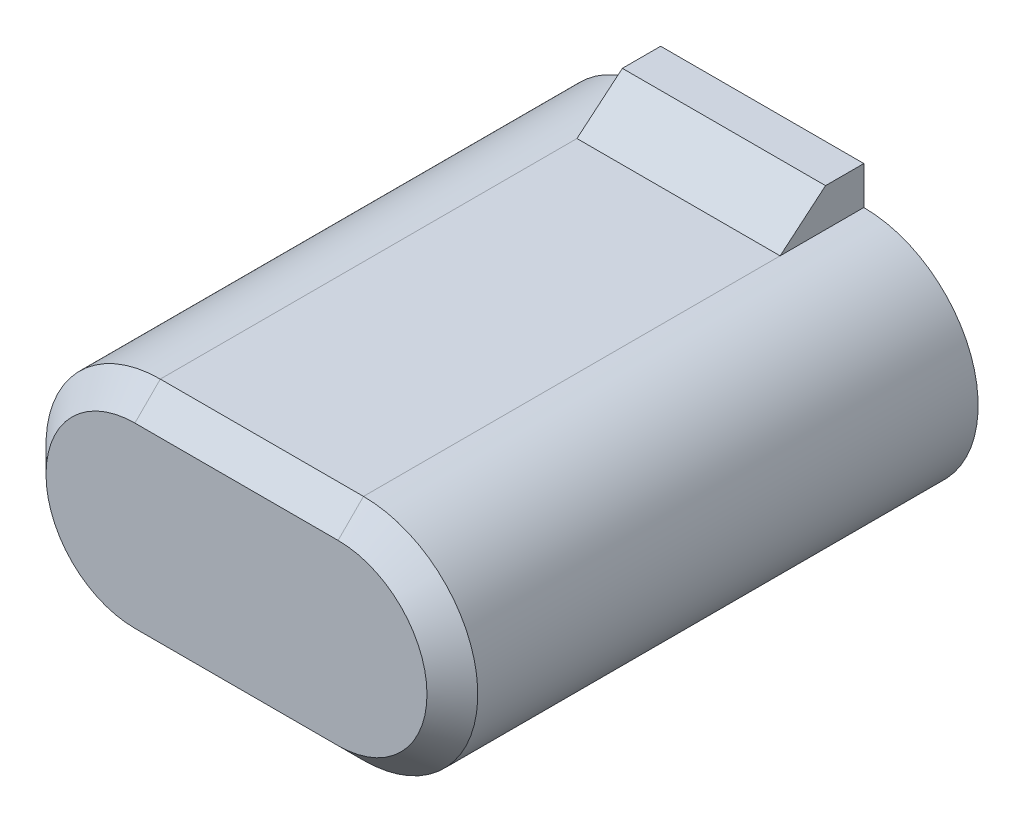
ISO-10303-21;
HEADER;
FILE_DESCRIPTION(('STEP AP214'),'2;1');
FILE_NAME('part.step','',(''),(''),'','','');
FILE_SCHEMA(('AUTOMOTIVE_DESIGN { 1 0 10303 214 1 1 1 1 }'));
ENDSEC;
DATA;
#1=APPLICATION_CONTEXT('core data for automotive mechanical design processes');
#2=APPLICATION_PROTOCOL_DEFINITION('international standard','automotive_design',2000,#1);
#3=PRODUCT_CONTEXT('',#1,'mechanical');
#4=PRODUCT('Part','Part','',(#3));
#5=PRODUCT_RELATED_PRODUCT_CATEGORY('part','',(#4));
#6=PRODUCT_DEFINITION_FORMATION('','',#4);
#7=PRODUCT_DEFINITION_CONTEXT('part definition',#1,'design');
#8=PRODUCT_DEFINITION('design','',#6,#7);
#9=PRODUCT_DEFINITION_SHAPE('','',#8);
#10=(LENGTH_UNIT() NAMED_UNIT(*) SI_UNIT(.MILLI.,.METRE.));
#11=(NAMED_UNIT(*) PLANE_ANGLE_UNIT() SI_UNIT($,.RADIAN.));
#12=(NAMED_UNIT(*) SI_UNIT($,.STERADIAN.) SOLID_ANGLE_UNIT());
#13=UNCERTAINTY_MEASURE_WITH_UNIT(LENGTH_MEASURE(1.E-05),#10,'distance_accuracy_value','');
#14=(GEOMETRIC_REPRESENTATION_CONTEXT(3) GLOBAL_UNCERTAINTY_ASSIGNED_CONTEXT((#13)) GLOBAL_UNIT_ASSIGNED_CONTEXT((#10,
#11,#12)) REPRESENTATION_CONTEXT('',''));
#15=CARTESIAN_POINT('',(0.,0.,0.));
#16=DIRECTION('',(0.,0.,1.));
#17=DIRECTION('',(1.,0.,0.));
#18=AXIS2_PLACEMENT_3D('',#15,#16,#17);
#19=CARTESIAN_POINT('',(-2.,-2.25,10.35));
#20=DIRECTION('',(0.,1.,0.));
#21=DIRECTION('',(-1.,0.,0.));
#22=AXIS2_PLACEMENT_3D('',#19,#20,#21);
#23=PLANE('',#22);
#24=DIRECTION('',(0.,0.,-1.));
#25=VECTOR('',#24,1.);
#26=CARTESIAN_POINT('',(2.,-2.25,10.35));
#27=LINE('',#26,#25);
#28=CARTESIAN_POINT('',(2.,-2.25,9.85));
#29=VERTEX_POINT('',#28);
#30=CARTESIAN_POINT('',(2.,-2.25,1.64793839814855));
#31=VERTEX_POINT('',#30);
#32=EDGE_CURVE('E203',#29,#31,#27,.T.);
#33=ORIENTED_EDGE('',*,*,#32,.F.);
#34=DIRECTION('',(-1.,0.,0.));
#35=VECTOR('',#34,1.);
#36=CARTESIAN_POINT('',(-2.,-2.25,9.85));
#37=LINE('',#36,#35);
#38=CARTESIAN_POINT('',(-2.,-2.25,9.85));
#39=VERTEX_POINT('',#38);
#40=EDGE_CURVE('E11',#29,#39,#37,.T.);
#41=ORIENTED_EDGE('',*,*,#40,.T.);
#42=DIRECTION('',(0.,0.,-1.));
#43=VECTOR('',#42,1.);
#44=CARTESIAN_POINT('',(-2.,-2.25,10.35));
#45=LINE('',#44,#43);
#46=CARTESIAN_POINT('',(-2.,-2.25,1.64793839814855));
#47=VERTEX_POINT('',#46);
#48=EDGE_CURVE('E205',#39,#47,#45,.T.);
#49=ORIENTED_EDGE('',*,*,#48,.T.);
#50=DIRECTION('',(-1.,0.,0.));
#51=VECTOR('',#50,1.);
#52=CARTESIAN_POINT('',(2.,-2.25,1.64793839814855));
#53=LINE('',#52,#51);
#54=EDGE_CURVE('E147',#31,#47,#53,.T.);
#55=ORIENTED_EDGE('',*,*,#54,.F.);
#56=EDGE_LOOP('',(#33,#41,#49,#55));
#57=FACE_BOUND('',#56,.T.);
#58=ADVANCED_FACE('F33',(#57),#23,.F.);
#59=CARTESIAN_POINT('',(-2.,2.25,10.35));
#60=DIRECTION('',(0.,-1.,0.));
#61=DIRECTION('',(1.,0.,0.));
#62=AXIS2_PLACEMENT_3D('',#59,#60,#61);
#63=PLANE('',#62);
#64=DIRECTION('',(0.,0.,-1.));
#65=VECTOR('',#64,1.);
#66=CARTESIAN_POINT('',(-2.,2.25,10.35));
#67=LINE('',#66,#65);
#68=CARTESIAN_POINT('',(-2.,2.25,9.85));
#69=VERTEX_POINT('',#68);
#70=CARTESIAN_POINT('',(-2.,2.25,1.64793839814855));
#71=VERTEX_POINT('',#70);
#72=EDGE_CURVE('E199',#69,#71,#67,.T.);
#73=ORIENTED_EDGE('',*,*,#72,.F.);
#74=DIRECTION('',(1.,0.,0.));
#75=VECTOR('',#74,1.);
#76=CARTESIAN_POINT('',(2.,2.25,9.85));
#77=LINE('',#76,#75);
#78=CARTESIAN_POINT('',(2.,2.25,9.85));
#79=VERTEX_POINT('',#78);
#80=EDGE_CURVE('E216',#69,#79,#77,.T.);
#81=ORIENTED_EDGE('',*,*,#80,.T.);
#82=DIRECTION('',(0.,0.,-1.));
#83=VECTOR('',#82,1.);
#84=CARTESIAN_POINT('',(2.,2.25,10.35));
#85=LINE('',#84,#83);
#86=CARTESIAN_POINT('',(2.,2.25,1.64793839814855));
#87=VERTEX_POINT('',#86);
#88=EDGE_CURVE('E201',#79,#87,#85,.T.);
#89=ORIENTED_EDGE('',*,*,#88,.T.);
#90=DIRECTION('',(-1.,0.,0.));
#91=VECTOR('',#90,1.);
#92=CARTESIAN_POINT('',(2.,2.25,1.64793839814855));
#93=LINE('',#92,#91);
#94=EDGE_CURVE('E188',#87,#71,#93,.T.);
#95=ORIENTED_EDGE('',*,*,#94,.T.);
#96=EDGE_LOOP('',(#73,#81,#89,#95));
#97=FACE_BOUND('',#96,.T.);
#98=ADVANCED_FACE('F245',(#97),#63,.F.);
#99=CARTESIAN_POINT('',(-2.,0.,10.35));
#100=DIRECTION('',(0.,0.,-1.));
#101=DIRECTION('',(-1.,0.,0.));
#102=AXIS2_PLACEMENT_3D('',#99,#100,#101);
#103=CYLINDRICAL_SURFACE('',#102,2.25);
#104=ORIENTED_EDGE('',*,*,#48,.F.);
#105=CARTESIAN_POINT('',(-2.,0.,9.85));
#106=DIRECTION('',(0.,0.,1.));
#107=DIRECTION('',(1.,0.,0.));
#108=AXIS2_PLACEMENT_3D('',#105,#106,#107);
#109=CIRCLE('',#108,2.25);
#110=EDGE_CURVE('E219',#39,#69,#109,.F.);
#111=ORIENTED_EDGE('',*,*,#110,.T.);
#112=ORIENTED_EDGE('',*,*,#72,.T.);
#113=DIRECTION('',(0.,0.,-1.));
#114=VECTOR('',#113,1.);
#115=CARTESIAN_POINT('',(-2.,2.25,1.64793839814855));
#116=LINE('',#115,#114);
#117=CARTESIAN_POINT('',(-2.,2.25,0.));
#118=VERTEX_POINT('',#117);
#119=EDGE_CURVE('E132',#71,#118,#116,.T.);
#120=ORIENTED_EDGE('',*,*,#119,.T.);
#121=CARTESIAN_POINT('',(-2.,0.,0.));
#122=DIRECTION('',(0.,0.,1.));
#123=DIRECTION('',(1.,0.,0.));
#124=AXIS2_PLACEMENT_3D('',#121,#122,#123);
#125=CIRCLE('',#124,2.25);
#126=CARTESIAN_POINT('',(-2.,-2.25,0.));
#127=VERTEX_POINT('',#126);
#128=EDGE_CURVE('E195',#118,#127,#125,.T.);
#129=ORIENTED_EDGE('',*,*,#128,.T.);
#130=DIRECTION('',(0.,0.,1.));
#131=VECTOR('',#130,1.);
#132=CARTESIAN_POINT('',(-2.,-2.25,1.64793839814855));
#133=LINE('',#132,#131);
#134=EDGE_CURVE('E153',#127,#47,#133,.T.);
#135=ORIENTED_EDGE('',*,*,#134,.T.);
#136=EDGE_LOOP('',(#104,#111,#112,#120,#129,#135));
#137=FACE_BOUND('',#136,.T.);
#138=ADVANCED_FACE('F265',(#137),#103,.T.);
#139=CARTESIAN_POINT('',(2.,0.,10.35));
#140=DIRECTION('',(0.,0.,-1.));
#141=DIRECTION('',(-1.,0.,0.));
#142=AXIS2_PLACEMENT_3D('',#139,#140,#141);
#143=CYLINDRICAL_SURFACE('',#142,2.25);
#144=ORIENTED_EDGE('',*,*,#88,.F.);
#145=CARTESIAN_POINT('',(2.,0.,9.85));
#146=DIRECTION('',(0.,0.,1.));
#147=DIRECTION('',(1.,0.,0.));
#148=AXIS2_PLACEMENT_3D('',#145,#146,#147);
#149=CIRCLE('',#148,2.25);
#150=EDGE_CURVE('E42',#79,#29,#149,.F.);
#151=ORIENTED_EDGE('',*,*,#150,.T.);
#152=ORIENTED_EDGE('',*,*,#32,.T.);
#153=DIRECTION('',(0.,0.,1.));
#154=VECTOR('',#153,1.);
#155=CARTESIAN_POINT('',(2.,-2.25,1.64793839814855));
#156=LINE('',#155,#154);
#157=CARTESIAN_POINT('',(2.,-2.25,0.));
#158=VERTEX_POINT('',#157);
#159=EDGE_CURVE('E162',#158,#31,#156,.T.);
#160=ORIENTED_EDGE('',*,*,#159,.F.);
#161=CARTESIAN_POINT('',(2.,0.,0.));
#162=DIRECTION('',(0.,0.,1.));
#163=DIRECTION('',(1.,0.,0.));
#164=AXIS2_PLACEMENT_3D('',#161,#162,#163);
#165=CIRCLE('',#164,2.25);
#166=CARTESIAN_POINT('',(2.,2.25,0.));
#167=VERTEX_POINT('',#166);
#168=EDGE_CURVE('E197',#158,#167,#165,.T.);
#169=ORIENTED_EDGE('',*,*,#168,.T.);
#170=DIRECTION('',(0.,0.,-1.));
#171=VECTOR('',#170,1.);
#172=CARTESIAN_POINT('',(2.,2.25,1.64793839814855));
#173=LINE('',#172,#171);
#174=EDGE_CURVE('E178',#87,#167,#173,.T.);
#175=ORIENTED_EDGE('',*,*,#174,.F.);
#176=EDGE_LOOP('',(#144,#151,#152,#160,#169,#175));
#177=FACE_BOUND('',#176,.T.);
#178=ADVANCED_FACE('F247',(#177),#143,.T.);
#179=CARTESIAN_POINT('',(-2.,0.,10.35));
#180=DIRECTION('',(0.,0.,1.));
#181=DIRECTION('',(1.,0.,0.));
#182=AXIS2_PLACEMENT_3D('',#179,#180,#181);
#183=PLANE('',#182);
#184=CARTESIAN_POINT('',(2.,0.,10.35));
#185=DIRECTION('',(0.,0.,1.));
#186=DIRECTION('',(1.,0.,0.));
#187=AXIS2_PLACEMENT_3D('',#184,#185,#186);
#188=CIRCLE('',#187,1.75);
#189=CARTESIAN_POINT('',(2.,-1.75,10.35));
#190=VERTEX_POINT('',#189);
#191=CARTESIAN_POINT('',(2.,1.75,10.35));
#192=VERTEX_POINT('',#191);
#193=EDGE_CURVE('E209',#190,#192,#188,.T.);
#194=ORIENTED_EDGE('',*,*,#193,.T.);
#195=DIRECTION('',(-1.,0.,0.));
#196=VECTOR('',#195,1.);
#197=CARTESIAN_POINT('',(-2.,1.75,10.35));
#198=LINE('',#197,#196);
#199=CARTESIAN_POINT('',(-2.,1.75,10.35));
#200=VERTEX_POINT('',#199);
#201=EDGE_CURVE('E213',#192,#200,#198,.T.);
#202=ORIENTED_EDGE('',*,*,#201,.T.);
#203=CARTESIAN_POINT('',(-2.,0.,10.35));
#204=DIRECTION('',(0.,0.,1.));
#205=DIRECTION('',(1.,0.,0.));
#206=AXIS2_PLACEMENT_3D('',#203,#204,#205);
#207=CIRCLE('',#206,1.75);
#208=CARTESIAN_POINT('',(-2.,-1.75,10.35));
#209=VERTEX_POINT('',#208);
#210=EDGE_CURVE('E211',#200,#209,#207,.T.);
#211=ORIENTED_EDGE('',*,*,#210,.T.);
#212=DIRECTION('',(1.,0.,0.));
#213=VECTOR('',#212,1.);
#214=CARTESIAN_POINT('',(2.,-1.75,10.35));
#215=LINE('',#214,#213);
#216=EDGE_CURVE('E207',#209,#190,#215,.T.);
#217=ORIENTED_EDGE('',*,*,#216,.T.);
#218=EDGE_LOOP('',(#194,#202,#211,#217));
#219=FACE_BOUND('',#218,.T.);
#220=ADVANCED_FACE('F237',(#219),#183,.T.);
#221=CARTESIAN_POINT('',(-2.,0.,0.));
#222=DIRECTION('',(0.,0.,1.));
#223=DIRECTION('',(1.,0.,0.));
#224=AXIS2_PLACEMENT_3D('',#221,#222,#223);
#225=PLANE('',#224);
#226=ORIENTED_EDGE('',*,*,#128,.F.);
#227=DIRECTION('',(0.,1.,0.));
#228=VECTOR('',#227,1.);
#229=CARTESIAN_POINT('',(-2.,3.,0.));
#230=LINE('',#229,#228);
#231=CARTESIAN_POINT('',(-2.,3.,0.));
#232=VERTEX_POINT('',#231);
#233=EDGE_CURVE('E169',#118,#232,#230,.T.);
#234=ORIENTED_EDGE('',*,*,#233,.T.);
#235=DIRECTION('',(-1.,0.,0.));
#236=VECTOR('',#235,1.);
#237=CARTESIAN_POINT('',(2.,3.,0.));
#238=LINE('',#237,#236);
#239=CARTESIAN_POINT('',(2.,3.,0.));
#240=VERTEX_POINT('',#239);
#241=EDGE_CURVE('E193',#240,#232,#238,.T.);
#242=ORIENTED_EDGE('',*,*,#241,.F.);
#243=DIRECTION('',(0.,1.,0.));
#244=VECTOR('',#243,1.);
#245=CARTESIAN_POINT('',(2.,3.,0.));
#246=LINE('',#245,#244);
#247=EDGE_CURVE('E181',#167,#240,#246,.T.);
#248=ORIENTED_EDGE('',*,*,#247,.F.);
#249=ORIENTED_EDGE('',*,*,#168,.F.);
#250=DIRECTION('',(0.,1.,0.));
#251=VECTOR('',#250,1.);
#252=CARTESIAN_POINT('',(2.,-3.,0.));
#253=LINE('',#252,#251);
#254=CARTESIAN_POINT('',(2.,-3.,0.));
#255=VERTEX_POINT('',#254);
#256=EDGE_CURVE('E159',#255,#158,#253,.T.);
#257=ORIENTED_EDGE('',*,*,#256,.F.);
#258=DIRECTION('',(-1.,0.,0.));
#259=VECTOR('',#258,1.);
#260=CARTESIAN_POINT('',(2.,-3.,0.));
#261=LINE('',#260,#259);
#262=CARTESIAN_POINT('',(-2.,-3.,0.));
#263=VERTEX_POINT('',#262);
#264=EDGE_CURVE('E133',#255,#263,#261,.T.);
#265=ORIENTED_EDGE('',*,*,#264,.T.);
#266=DIRECTION('',(0.,1.,0.));
#267=VECTOR('',#266,1.);
#268=CARTESIAN_POINT('',(-2.,-3.,0.));
#269=LINE('',#268,#267);
#270=EDGE_CURVE('E142',#263,#127,#269,.T.);
#271=ORIENTED_EDGE('',*,*,#270,.T.);
#272=EDGE_LOOP('',(#226,#234,#242,#248,#249,#257,#265,#271));
#273=FACE_BOUND('',#272,.T.);
#274=ADVANCED_FACE('F270',(#273),#225,.F.);
#275=CARTESIAN_POINT('',(2.,3.,0.754123203702897));
#276=DIRECTION('',(0.,-1.,0.));
#277=DIRECTION('',(0.,0.,-1.));
#278=AXIS2_PLACEMENT_3D('',#275,#276,#277);
#279=PLANE('',#278);
#280=ORIENTED_EDGE('',*,*,#241,.T.);
#281=DIRECTION('',(0.,0.,1.));
#282=VECTOR('',#281,1.);
#283=CARTESIAN_POINT('',(-2.,3.,0.754123203702897));
#284=LINE('',#283,#282);
#285=CARTESIAN_POINT('',(-2.,3.,0.754123203702897));
#286=VERTEX_POINT('',#285);
#287=EDGE_CURVE('E172',#232,#286,#284,.T.);
#288=ORIENTED_EDGE('',*,*,#287,.T.);
#289=DIRECTION('',(-1.,0.,0.));
#290=VECTOR('',#289,1.);
#291=CARTESIAN_POINT('',(2.,3.,0.754123203702897));
#292=LINE('',#291,#290);
#293=CARTESIAN_POINT('',(2.,3.,0.754123203702897));
#294=VERTEX_POINT('',#293);
#295=EDGE_CURVE('E191',#294,#286,#292,.T.);
#296=ORIENTED_EDGE('',*,*,#295,.F.);
#297=DIRECTION('',(0.,0.,1.));
#298=VECTOR('',#297,1.);
#299=CARTESIAN_POINT('',(2.,3.,0.754123203702897));
#300=LINE('',#299,#298);
#301=EDGE_CURVE('E183',#240,#294,#300,.T.);
#302=ORIENTED_EDGE('',*,*,#301,.F.);
#303=EDGE_LOOP('',(#280,#288,#296,#302));
#304=FACE_BOUND('',#303,.T.);
#305=ADVANCED_FACE('F273',(#304),#279,.F.);
#306=CARTESIAN_POINT('',(2.,2.25,1.64793839814855));
#307=DIRECTION('',(0.,-0.766044443118977,-0.64278760968654));
#308=DIRECTION('',(0.,0.64278760968654,-0.766044443118977));
#309=AXIS2_PLACEMENT_3D('',#306,#307,#308);
#310=PLANE('',#309);
#311=ORIENTED_EDGE('',*,*,#295,.T.);
#312=DIRECTION('',(0.,-0.64278760968654,0.766044443118977));
#313=VECTOR('',#312,1.);
#314=CARTESIAN_POINT('',(-2.,2.25,1.64793839814855));
#315=LINE('',#314,#313);
#316=EDGE_CURVE('E175',#286,#71,#315,.T.);
#317=ORIENTED_EDGE('',*,*,#316,.T.);
#318=ORIENTED_EDGE('',*,*,#94,.F.);
#319=DIRECTION('',(0.,-0.64278760968654,0.766044443118977));
#320=VECTOR('',#319,1.);
#321=CARTESIAN_POINT('',(2.,2.25,1.64793839814855));
#322=LINE('',#321,#320);
#323=EDGE_CURVE('E185',#294,#87,#322,.T.);
#324=ORIENTED_EDGE('',*,*,#323,.F.);
#325=EDGE_LOOP('',(#311,#317,#318,#324));
#326=FACE_BOUND('',#325,.T.);
#327=ADVANCED_FACE('F257',(#326),#310,.F.);
#328=CARTESIAN_POINT('',(2.,0.,0.));
#329=DIRECTION('',(-1.,0.,0.));
#330=DIRECTION('',(0.,0.,1.));
#331=AXIS2_PLACEMENT_3D('',#328,#329,#330);
#332=PLANE('',#331);
#333=ORIENTED_EDGE('',*,*,#174,.T.);
#334=ORIENTED_EDGE('',*,*,#247,.T.);
#335=ORIENTED_EDGE('',*,*,#301,.T.);
#336=ORIENTED_EDGE('',*,*,#323,.T.);
#337=EDGE_LOOP('',(#333,#334,#335,#336));
#338=FACE_BOUND('',#337,.T.);
#339=ADVANCED_FACE('F253',(#338),#332,.F.);
#340=CARTESIAN_POINT('',(-2.,0.,0.));
#341=DIRECTION('',(-1.,0.,0.));
#342=DIRECTION('',(0.,0.,1.));
#343=AXIS2_PLACEMENT_3D('',#340,#341,#342);
#344=PLANE('',#343);
#345=ORIENTED_EDGE('',*,*,#119,.F.);
#346=ORIENTED_EDGE('',*,*,#316,.F.);
#347=ORIENTED_EDGE('',*,*,#287,.F.);
#348=ORIENTED_EDGE('',*,*,#233,.F.);
#349=EDGE_LOOP('',(#345,#346,#347,#348));
#350=FACE_BOUND('',#349,.T.);
#351=ADVANCED_FACE('F262',(#350),#344,.T.);
#352=CARTESIAN_POINT('',(2.,-2.25,1.64793839814855));
#353=DIRECTION('',(0.,0.766044443118977,-0.64278760968654));
#354=DIRECTION('',(0.,0.64278760968654,0.766044443118977));
#355=AXIS2_PLACEMENT_3D('',#352,#353,#354);
#356=PLANE('',#355);
#357=ORIENTED_EDGE('',*,*,#54,.T.);
#358=DIRECTION('',(0.,-0.64278760968654,-0.766044443118977));
#359=VECTOR('',#358,1.);
#360=CARTESIAN_POINT('',(-2.,-2.25,1.64793839814855));
#361=LINE('',#360,#359);
#362=CARTESIAN_POINT('',(-2.,-3.,0.754123203702897));
#363=VERTEX_POINT('',#362);
#364=EDGE_CURVE('E140',#47,#363,#361,.T.);
#365=ORIENTED_EDGE('',*,*,#364,.T.);
#366=DIRECTION('',(-1.,0.,0.));
#367=VECTOR('',#366,1.);
#368=CARTESIAN_POINT('',(2.,-3.,0.754123203702897));
#369=LINE('',#368,#367);
#370=CARTESIAN_POINT('',(2.,-3.,0.754123203702897));
#371=VERTEX_POINT('',#370);
#372=EDGE_CURVE('E122',#371,#363,#369,.T.);
#373=ORIENTED_EDGE('',*,*,#372,.F.);
#374=DIRECTION('',(0.,-0.64278760968654,-0.766044443118977));
#375=VECTOR('',#374,1.);
#376=CARTESIAN_POINT('',(2.,-2.25,1.64793839814855));
#377=LINE('',#376,#375);
#378=EDGE_CURVE('E156',#31,#371,#377,.T.);
#379=ORIENTED_EDGE('',*,*,#378,.F.);
#380=EDGE_LOOP('',(#357,#365,#373,#379));
#381=FACE_BOUND('',#380,.T.);
#382=ADVANCED_FACE('F145',(#381),#356,.F.);
#383=CARTESIAN_POINT('',(2.,-3.,0.754123203702897));
#384=DIRECTION('',(0.,1.,0.));
#385=DIRECTION('',(0.,0.,1.));
#386=AXIS2_PLACEMENT_3D('',#383,#384,#385);
#387=PLANE('',#386);
#388=ORIENTED_EDGE('',*,*,#372,.T.);
#389=DIRECTION('',(0.,0.,-1.));
#390=VECTOR('',#389,1.);
#391=CARTESIAN_POINT('',(-2.,-3.,0.754123203702897));
#392=LINE('',#391,#390);
#393=EDGE_CURVE('E126',#363,#263,#392,.T.);
#394=ORIENTED_EDGE('',*,*,#393,.T.);
#395=ORIENTED_EDGE('',*,*,#264,.F.);
#396=DIRECTION('',(0.,0.,-1.));
#397=VECTOR('',#396,1.);
#398=CARTESIAN_POINT('',(2.,-3.,0.754123203702897));
#399=LINE('',#398,#397);
#400=EDGE_CURVE('E127',#371,#255,#399,.T.);
#401=ORIENTED_EDGE('',*,*,#400,.F.);
#402=EDGE_LOOP('',(#388,#394,#395,#401));
#403=FACE_BOUND('',#402,.T.);
#404=ADVANCED_FACE('F124',(#403),#387,.F.);
#405=CARTESIAN_POINT('',(2.,0.,0.));
#406=DIRECTION('',(1.,0.,0.));
#407=DIRECTION('',(0.,0.,-1.));
#408=AXIS2_PLACEMENT_3D('',#405,#406,#407);
#409=PLANE('',#408);
#410=ORIENTED_EDGE('',*,*,#378,.T.);
#411=ORIENTED_EDGE('',*,*,#400,.T.);
#412=ORIENTED_EDGE('',*,*,#256,.T.);
#413=ORIENTED_EDGE('',*,*,#159,.T.);
#414=EDGE_LOOP('',(#410,#411,#412,#413));
#415=FACE_BOUND('',#414,.T.);
#416=ADVANCED_FACE('F267',(#415),#409,.T.);
#417=CARTESIAN_POINT('',(-2.,0.,0.));
#418=DIRECTION('',(1.,0.,0.));
#419=DIRECTION('',(0.,0.,-1.));
#420=AXIS2_PLACEMENT_3D('',#417,#418,#419);
#421=PLANE('',#420);
#422=ORIENTED_EDGE('',*,*,#364,.F.);
#423=ORIENTED_EDGE('',*,*,#134,.F.);
#424=ORIENTED_EDGE('',*,*,#270,.F.);
#425=ORIENTED_EDGE('',*,*,#393,.F.);
#426=EDGE_LOOP('',(#422,#423,#424,#425));
#427=FACE_BOUND('',#426,.T.);
#428=ADVANCED_FACE('F138',(#427),#421,.F.);
#429=CARTESIAN_POINT('',(-2.,-1.75,10.35));
#430=DIRECTION('',(0.,-0.707106781186549,0.707106781186546));
#431=DIRECTION('',(-1.,0.,0.));
#432=AXIS2_PLACEMENT_3D('',#429,#430,#431);
#433=PLANE('',#432);
#434=DIRECTION('',(0.,0.707106781186546,0.707106781186549));
#435=VECTOR('',#434,1.);
#436=CARTESIAN_POINT('',(-2.,-2.25,9.85));
#437=LINE('',#436,#435);
#438=EDGE_CURVE('E150',#39,#209,#437,.T.);
#439=ORIENTED_EDGE('',*,*,#438,.F.);
#440=ORIENTED_EDGE('',*,*,#40,.F.);
#441=DIRECTION('',(0.,-0.707106781186546,-0.707106781186549));
#442=VECTOR('',#441,1.);
#443=CARTESIAN_POINT('',(2.,-1.75,10.35));
#444=LINE('',#443,#442);
#445=EDGE_CURVE('E37',#190,#29,#444,.T.);
#446=ORIENTED_EDGE('',*,*,#445,.F.);
#447=ORIENTED_EDGE('',*,*,#216,.F.);
#448=EDGE_LOOP('',(#439,#440,#446,#447));
#449=FACE_BOUND('',#448,.T.);
#450=ADVANCED_FACE('F35',(#449),#433,.T.);
#451=CARTESIAN_POINT('',(2.,0.,10.35));
#452=DIRECTION('',(0.,0.,-1.));
#453=DIRECTION('',(-1.,0.,0.));
#454=AXIS2_PLACEMENT_3D('',#451,#452,#453);
#455=CONICAL_SURFACE('',#454,1.75,0.785398163397447);
#456=ORIENTED_EDGE('',*,*,#445,.T.);
#457=ORIENTED_EDGE('',*,*,#150,.F.);
#458=DIRECTION('',(0.,0.707106781186546,-0.707106781186549));
#459=VECTOR('',#458,1.);
#460=CARTESIAN_POINT('',(2.,1.75,10.35));
#461=LINE('',#460,#459);
#462=EDGE_CURVE('E224',#192,#79,#461,.T.);
#463=ORIENTED_EDGE('',*,*,#462,.F.);
#464=ORIENTED_EDGE('',*,*,#193,.F.);
#465=EDGE_LOOP('',(#456,#457,#463,#464));
#466=FACE_BOUND('',#465,.T.);
#467=ADVANCED_FACE('F296',(#466),#455,.T.);
#468=CARTESIAN_POINT('',(-2.,0.,10.35));
#469=DIRECTION('',(0.,0.,-1.));
#470=DIRECTION('',(-1.,0.,0.));
#471=AXIS2_PLACEMENT_3D('',#468,#469,#470);
#472=CONICAL_SURFACE('',#471,1.75,0.785398163397447);
#473=ORIENTED_EDGE('',*,*,#438,.T.);
#474=ORIENTED_EDGE('',*,*,#210,.F.);
#475=DIRECTION('',(0.,-0.707106781186546,0.707106781186549));
#476=VECTOR('',#475,1.);
#477=CARTESIAN_POINT('',(-2.,2.25,9.85));
#478=LINE('',#477,#476);
#479=EDGE_CURVE('E222',#69,#200,#478,.T.);
#480=ORIENTED_EDGE('',*,*,#479,.F.);
#481=ORIENTED_EDGE('',*,*,#110,.F.);
#482=EDGE_LOOP('',(#473,#474,#480,#481));
#483=FACE_BOUND('',#482,.T.);
#484=ADVANCED_FACE('F230',(#483),#472,.T.);
#485=CARTESIAN_POINT('',(-2.,1.75,10.35));
#486=DIRECTION('',(0.,0.707106781186549,0.707106781186546));
#487=DIRECTION('',(1.,0.,0.));
#488=AXIS2_PLACEMENT_3D('',#485,#486,#487);
#489=PLANE('',#488);
#490=ORIENTED_EDGE('',*,*,#462,.T.);
#491=ORIENTED_EDGE('',*,*,#80,.F.);
#492=ORIENTED_EDGE('',*,*,#479,.T.);
#493=ORIENTED_EDGE('',*,*,#201,.F.);
#494=EDGE_LOOP('',(#490,#491,#492,#493));
#495=FACE_BOUND('',#494,.T.);
#496=ADVANCED_FACE('F241',(#495),#489,.T.);
#497=CLOSED_SHELL('',(#58,#98,#138,#178,#220,#274,#305,#327,#339,#351,#382,#404,#416,#428,#450,
#467,#484,#496));
#498=MANIFOLD_SOLID_BREP('B2',#497);
#499=ADVANCED_BREP_SHAPE_REPRESENTATION('',(#18,#498),#14);
#500=SHAPE_DEFINITION_REPRESENTATION(#9,#499);
ENDSEC;
END-ISO-10303-21;
